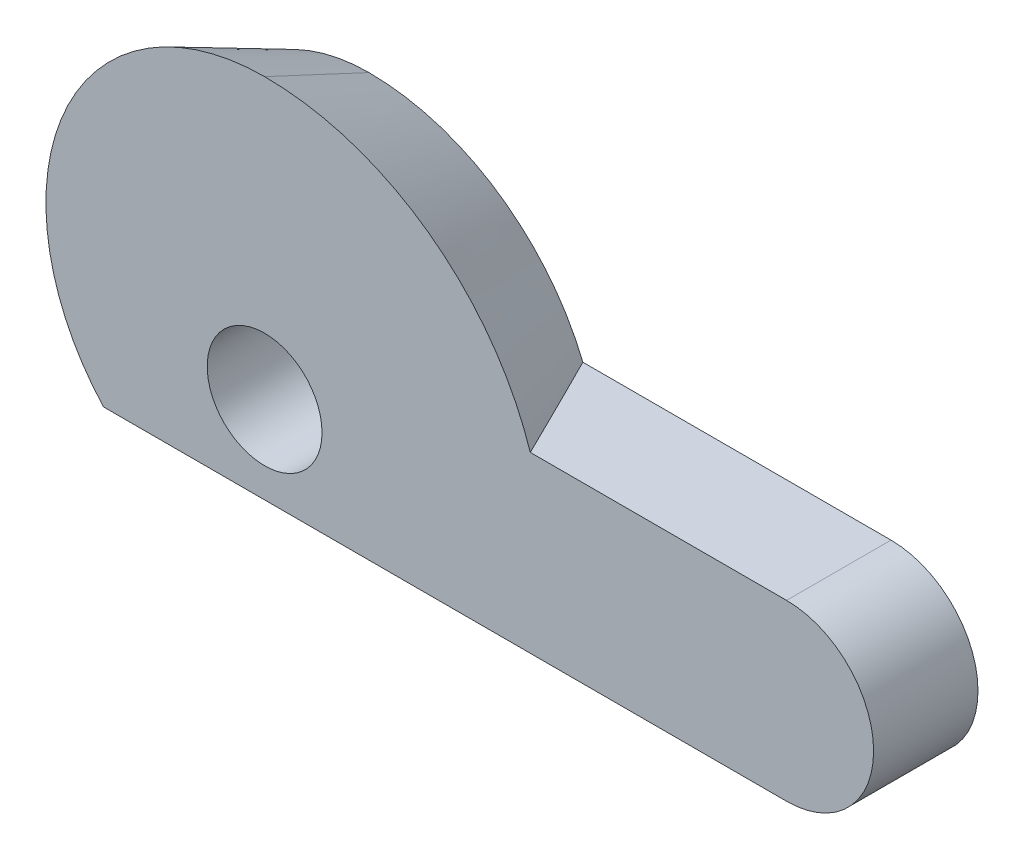
ISO-10303-21;
HEADER;
FILE_DESCRIPTION(('STEP AP214'),'2;1');
FILE_NAME('part.step','',(''),(''),'','','');
FILE_SCHEMA(('AUTOMOTIVE_DESIGN { 1 0 10303 214 1 1 1 1 }'));
ENDSEC;
DATA;
#1=APPLICATION_CONTEXT('core data for automotive mechanical design processes');
#2=APPLICATION_PROTOCOL_DEFINITION('international standard','automotive_design',2000,#1);
#3=PRODUCT_CONTEXT('',#1,'mechanical');
#4=PRODUCT('Part','Part','',(#3));
#5=PRODUCT_RELATED_PRODUCT_CATEGORY('part','',(#4));
#6=PRODUCT_DEFINITION_FORMATION('','',#4);
#7=PRODUCT_DEFINITION_CONTEXT('part definition',#1,'design');
#8=PRODUCT_DEFINITION('design','',#6,#7);
#9=PRODUCT_DEFINITION_SHAPE('','',#8);
#10=(LENGTH_UNIT() NAMED_UNIT(*) SI_UNIT(.MILLI.,.METRE.));
#11=(NAMED_UNIT(*) PLANE_ANGLE_UNIT() SI_UNIT($,.RADIAN.));
#12=(NAMED_UNIT(*) SI_UNIT($,.STERADIAN.) SOLID_ANGLE_UNIT());
#13=UNCERTAINTY_MEASURE_WITH_UNIT(LENGTH_MEASURE(1.E-05),#10,'distance_accuracy_value','');
#14=(GEOMETRIC_REPRESENTATION_CONTEXT(3) GLOBAL_UNCERTAINTY_ASSIGNED_CONTEXT((#13)) GLOBAL_UNIT_ASSIGNED_CONTEXT((#10,
#11,#12)) REPRESENTATION_CONTEXT('',''));
#15=CARTESIAN_POINT('',(0.,0.,0.));
#16=DIRECTION('',(0.,0.,1.));
#17=DIRECTION('',(1.,0.,0.));
#18=AXIS2_PLACEMENT_3D('',#15,#16,#17);
#19=CARTESIAN_POINT('',(15.,0.,3.));
#20=DIRECTION('',(0.,0.,1.));
#21=DIRECTION('',(1.,0.,0.));
#22=AXIS2_PLACEMENT_3D('',#19,#20,#21);
#23=PLANE('',#22);
#24=CARTESIAN_POINT('',(0.,1.75,3.));
#25=DIRECTION('',(0.,0.,1.));
#26=DIRECTION('',(1.,0.,0.));
#27=AXIS2_PLACEMENT_3D('',#24,#25,#26);
#28=CIRCLE('',#27,6.28369234184499);
#29=CARTESIAN_POINT('',(0.,8.03369234184498,3.));
#30=VERTEX_POINT('',#29);
#31=CARTESIAN_POINT('',(-4.62842191756125,-2.5,3.));
#32=VERTEX_POINT('',#31);
#33=EDGE_CURVE('E110',#30,#32,#28,.T.);
#34=ORIENTED_EDGE('',*,*,#33,.T.);
#35=DIRECTION('',(1.,0.,0.));
#36=VECTOR('',#35,1.);
#37=CARTESIAN_POINT('',(15.,-2.5,3.));
#38=LINE('',#37,#36);
#39=CARTESIAN_POINT('',(15.,-2.5,3.));
#40=VERTEX_POINT('',#39);
#41=EDGE_CURVE('E55',#32,#40,#38,.T.);
#42=ORIENTED_EDGE('',*,*,#41,.T.);
#43=CARTESIAN_POINT('',(15.,0.,3.));
#44=DIRECTION('',(0.,0.,1.));
#45=DIRECTION('',(1.,0.,0.));
#46=AXIS2_PLACEMENT_3D('',#43,#44,#45);
#47=CIRCLE('',#46,2.5);
#48=CARTESIAN_POINT('',(15.,2.5,3.));
#49=VERTEX_POINT('',#48);
#50=EDGE_CURVE('E97',#40,#49,#47,.T.);
#51=ORIENTED_EDGE('',*,*,#50,.T.);
#52=DIRECTION('',(-1.,0.,0.));
#53=VECTOR('',#52,1.);
#54=CARTESIAN_POINT('',(15.,2.5,3.));
#55=LINE('',#54,#53);
#56=CARTESIAN_POINT('',(7.63480272459078,2.5,3.));
#57=VERTEX_POINT('',#56);
#58=EDGE_CURVE('E63',#49,#57,#55,.T.);
#59=ORIENTED_EDGE('',*,*,#58,.T.);
#60=CARTESIAN_POINT('',(0.,0.,3.));
#61=DIRECTION('',(0.,0.,1.));
#62=DIRECTION('',(1.,0.,0.));
#63=AXIS2_PLACEMENT_3D('',#60,#61,#62);
#64=CIRCLE('',#63,8.03369234184503);
#65=EDGE_CURVE('E118',#57,#30,#64,.T.);
#66=ORIENTED_EDGE('',*,*,#65,.T.);
#67=EDGE_LOOP('',(#34,#42,#51,#59,#66));
#68=FACE_BOUND('',#67,.T.);
#69=CARTESIAN_POINT('',(0.,0.,3.));
#70=DIRECTION('',(0.,0.,1.));
#71=DIRECTION('',(1.,0.,0.));
#72=AXIS2_PLACEMENT_3D('',#69,#70,#71);
#73=CIRCLE('',#72,1.65);
#74=CARTESIAN_POINT('',(1.65,0.,3.));
#75=VERTEX_POINT('',#74);
#76=EDGE_CURVE('E160',#75,#75,#73,.T.);
#77=ORIENTED_EDGE('',*,*,#76,.F.);
#78=EDGE_LOOP('',(#77));
#79=FACE_BOUND('',#78,.T.);
#80=ADVANCED_FACE('F35',(#68,#79),#23,.T.);
#81=CARTESIAN_POINT('',(15.,0.,0.));
#82=DIRECTION('',(0.,0.,1.));
#83=DIRECTION('',(1.,0.,0.));
#84=AXIS2_PLACEMENT_3D('',#81,#82,#83);
#85=PLANE('',#84);
#86=DIRECTION('',(1.,0.,0.));
#87=VECTOR('',#86,1.);
#88=CARTESIAN_POINT('',(15.,-2.5,0.));
#89=LINE('',#88,#87);
#90=CARTESIAN_POINT('',(-2.40800161388934,-2.5,0.));
#91=VERTEX_POINT('',#90);
#92=CARTESIAN_POINT('',(15.,-2.5,0.));
#93=VERTEX_POINT('',#92);
#94=EDGE_CURVE('E87',#91,#93,#89,.T.);
#95=ORIENTED_EDGE('',*,*,#94,.F.);
#96=CARTESIAN_POINT('',(0.,1.75,0.));
#97=DIRECTION('',(0.,0.,1.));
#98=DIRECTION('',(1.,0.,0.));
#99=AXIS2_PLACEMENT_3D('',#96,#97,#98);
#100=CIRCLE('',#99,4.88476936737997);
#101=CARTESIAN_POINT('',(0.,6.63476936737997,0.));
#102=VERTEX_POINT('',#101);
#103=EDGE_CURVE('E92',#91,#102,#100,.F.);
#104=ORIENTED_EDGE('',*,*,#103,.T.);
#105=CARTESIAN_POINT('',(0.,0.,0.));
#106=DIRECTION('',(0.,0.,1.));
#107=DIRECTION('',(1.,0.,0.));
#108=AXIS2_PLACEMENT_3D('',#105,#106,#107);
#109=CIRCLE('',#108,6.63476936738001);
#110=CARTESIAN_POINT('',(6.14574361312962,2.5,0.));
#111=VERTEX_POINT('',#110);
#112=EDGE_CURVE('E107',#102,#111,#109,.F.);
#113=ORIENTED_EDGE('',*,*,#112,.T.);
#114=DIRECTION('',(-1.,0.,0.));
#115=VECTOR('',#114,1.);
#116=CARTESIAN_POINT('',(15.,2.5,0.));
#117=LINE('',#116,#115);
#118=CARTESIAN_POINT('',(15.,2.5,0.));
#119=VERTEX_POINT('',#118);
#120=EDGE_CURVE('E98',#119,#111,#117,.T.);
#121=ORIENTED_EDGE('',*,*,#120,.F.);
#122=CARTESIAN_POINT('',(15.,0.,0.));
#123=DIRECTION('',(0.,0.,1.));
#124=DIRECTION('',(1.,0.,0.));
#125=AXIS2_PLACEMENT_3D('',#122,#123,#124);
#126=CIRCLE('',#125,2.5);
#127=EDGE_CURVE('E95',#93,#119,#126,.T.);
#128=ORIENTED_EDGE('',*,*,#127,.F.);
#129=EDGE_LOOP('',(#95,#104,#113,#121,#128));
#130=FACE_BOUND('',#129,.T.);
#131=CARTESIAN_POINT('',(0.,0.,0.));
#132=DIRECTION('',(0.,0.,1.));
#133=DIRECTION('',(1.,0.,0.));
#134=AXIS2_PLACEMENT_3D('',#131,#132,#133);
#135=CIRCLE('',#134,1.65);
#136=CARTESIAN_POINT('',(1.65,0.,0.));
#137=VERTEX_POINT('',#136);
#138=EDGE_CURVE('E163',#137,#137,#135,.T.);
#139=ORIENTED_EDGE('',*,*,#138,.T.);
#140=EDGE_LOOP('',(#139));
#141=FACE_BOUND('',#140,.T.);
#142=ADVANCED_FACE('F88',(#130,#141),#85,.F.);
#143=CARTESIAN_POINT('',(15.,0.,3.));
#144=DIRECTION('',(0.,0.,-1.));
#145=DIRECTION('',(-1.,0.,0.));
#146=AXIS2_PLACEMENT_3D('',#143,#144,#145);
#147=CYLINDRICAL_SURFACE('',#146,2.5);
#148=ORIENTED_EDGE('',*,*,#127,.T.);
#149=DIRECTION('',(0.,0.,-1.));
#150=VECTOR('',#149,1.);
#151=CARTESIAN_POINT('',(15.,2.5,3.));
#152=LINE('',#151,#150);
#153=EDGE_CURVE('E108',#49,#119,#152,.T.);
#154=ORIENTED_EDGE('',*,*,#153,.F.);
#155=ORIENTED_EDGE('',*,*,#50,.F.);
#156=DIRECTION('',(0.,0.,-1.));
#157=VECTOR('',#156,1.);
#158=CARTESIAN_POINT('',(15.,-2.5,3.));
#159=LINE('',#158,#157);
#160=EDGE_CURVE('E113',#40,#93,#159,.T.);
#161=ORIENTED_EDGE('',*,*,#160,.T.);
#162=EDGE_LOOP('',(#148,#154,#155,#161));
#163=FACE_BOUND('',#162,.T.);
#164=ADVANCED_FACE('F133',(#163),#147,.T.);
#165=CARTESIAN_POINT('',(15.,2.5,3.));
#166=DIRECTION('',(0.,-1.,0.));
#167=DIRECTION('',(1.,0.,0.));
#168=AXIS2_PLACEMENT_3D('',#165,#166,#167);
#169=PLANE('',#168);
#170=ORIENTED_EDGE('',*,*,#120,.T.);
#171=CARTESIAN_POINT('',(6.14574361312962,2.5,0.));
#172=CARTESIAN_POINT('',(6.27123816993568,2.5,0.249299944932188));
#173=CARTESIAN_POINT('',(6.39630707149005,2.5,0.49881368096005));
#174=CARTESIAN_POINT('',(6.64570803873967,2.5,0.998207205430879));
#175=CARTESIAN_POINT('',(6.77004010915447,2.5,1.24808699151641));
#176=CARTESIAN_POINT('',(7.01808328175662,2.5,1.74815385466408));
#177=CARTESIAN_POINT('',(7.14179438501223,2.5,1.99834093119666));
#178=CARTESIAN_POINT('',(7.38868017891951,2.5,2.49898163920479));
#179=CARTESIAN_POINT('',(7.51185486613386,2.5,2.74943527237565));
#180=CARTESIAN_POINT('',(7.63480272459079,2.5,3.));
#181=B_SPLINE_CURVE_WITH_KNOTS('',3,(#171,#172,#173,#174,#175,#176,#177,#178,#179,#180),
.UNSPECIFIED.,.F.,.F.,(4,2,2,2,4),(0.,0.837312610810785,1.67461985266571,2.51192565358894,
3.34923681202343),.UNSPECIFIED.);
#182=EDGE_CURVE('E49',#111,#57,#181,.T.);
#183=ORIENTED_EDGE('',*,*,#182,.T.);
#184=ORIENTED_EDGE('',*,*,#58,.F.);
#185=ORIENTED_EDGE('',*,*,#153,.T.);
#186=EDGE_LOOP('',(#170,#183,#184,#185));
#187=FACE_BOUND('',#186,.T.);
#188=ADVANCED_FACE('F125',(#187),#169,.F.);
#189=CARTESIAN_POINT('',(15.,-2.5,3.));
#190=DIRECTION('',(0.,1.,0.));
#191=DIRECTION('',(0.,0.,1.));
#192=AXIS2_PLACEMENT_3D('',#189,#190,#191);
#193=PLANE('',#192);
#194=ORIENTED_EDGE('',*,*,#160,.F.);
#195=ORIENTED_EDGE('',*,*,#41,.F.);
#196=CARTESIAN_POINT('',(-7.05000504901995,-2.5,7.17806119933467));
#197=CARTESIAN_POINT('',(-6.93579314198168,-2.5,6.96831607321156));
#198=CARTESIAN_POINT('',(-6.82102302615533,-2.5,6.75887318474393));
#199=CARTESIAN_POINT('',(-6.59016724566101,-2.5,6.34070622949557));
#200=CARTESIAN_POINT('',(-6.47408154384453,-2.5,6.13198218323103));
#201=CARTESIAN_POINT('',(-6.24029663603367,-2.5,5.71519147578387));
#202=CARTESIAN_POINT('',(-6.12259607056551,-2.5,5.50712557630712));
#203=CARTESIAN_POINT('',(-5.88543233404295,-2.5,5.09200239255196));
#204=CARTESIAN_POINT('',(-5.76596917972948,-2.5,4.88494509871872));
#205=CARTESIAN_POINT('',(-5.52258063412192,-2.5,4.46794994862103));
#206=CARTESIAN_POINT('',(-5.398613727738,-2.5,4.25803628851881));
#207=CARTESIAN_POINT('',(-5.14810448406988,-2.5,3.83975209335732));
#208=CARTESIAN_POINT('',(-5.02156217746971,-2.5,3.63138153995336));
#209=CARTESIAN_POINT('',(-4.76540968158676,-2.5,3.21664181289098));
#210=CARTESIAN_POINT('',(-4.63580070147002,-2.5,3.01027189419551));
#211=CARTESIAN_POINT('',(-4.37276294762327,-2.5,2.59998756365815));
#212=CARTESIAN_POINT('',(-4.23933435364602,-2.5,2.3960730369039));
#213=CARTESIAN_POINT('',(-3.96828296273199,-2.5,1.99231649986878));
#214=CARTESIAN_POINT('',(-3.83068085261915,-2.5,1.79246066829881));
#215=CARTESIAN_POINT('',(-3.54938514444876,-2.5,1.39696500811119));
#216=CARTESIAN_POINT('',(-3.40568953648558,-2.5,1.20132660319144));
#217=CARTESIAN_POINT('',(-3.11115104667324,-2.5,0.817011958335836));
#218=CARTESIAN_POINT('',(-2.9603485115205,-2.5,0.628305208852511));
#219=CARTESIAN_POINT('',(-2.72633234530842,-2.5,0.351936272415993));
#220=CARTESIAN_POINT('',(-2.64704646519733,-2.5,0.260951215856611));
#221=CARTESIAN_POINT('',(-2.48539783079971,-2.5,0.0817643955029092));
#222=CARTESIAN_POINT('',(-2.40303538420546,-2.5,-0.00643764500630492));
#223=CARTESIAN_POINT('',(-2.19371510379667,-2.5,-0.221456240041877));
#224=CARTESIAN_POINT('',(-2.06456821959043,-2.5,-0.346165799595977));
#225=CARTESIAN_POINT('',(-1.79568628099834,-2.5,-0.584632777591295));
#226=CARTESIAN_POINT('',(-1.65592624765185,-2.5,-0.698362831651144));
#227=CARTESIAN_POINT('',(-1.43565434264966,-2.5,-0.856462663631282));
#228=CARTESIAN_POINT('',(-1.35986891805872,-2.5,-0.907402906957797));
#229=CARTESIAN_POINT('',(-1.20467778052415,-2.5,-1.00353998881682));
#230=CARTESIAN_POINT('',(-1.12527133807683,-2.5,-1.0487356630191));
#231=CARTESIAN_POINT('',(-0.963036894207919,-2.5,-1.13172599466102));
#232=CARTESIAN_POINT('',(-0.880224083007756,-2.5,-1.1695499375752));
#233=CARTESIAN_POINT('',(-0.711126663513296,-2.5,-1.2362804338859));
#234=CARTESIAN_POINT('',(-0.624845141505748,-2.5,-1.26519472447433));
#235=CARTESIAN_POINT('',(-0.425000818125529,-2.5,-1.31889887327013));
#236=CARTESIAN_POINT('',(-0.310494694978523,-2.5,-1.34033428463522));
#237=CARTESIAN_POINT('',(-0.0795515419635326,-2.5,-1.36301883945269));
#238=CARTESIAN_POINT('',(0.036883499926279,-2.5,-1.36428761132961));
#239=CARTESIAN_POINT('',(0.26800834448745,-2.5,-1.34652420976068));
#240=CARTESIAN_POINT('',(0.382699886523279,-2.5,-1.32751382832712));
#241=CARTESIAN_POINT('',(0.607623878105413,-2.5,-1.27171979126082));
#242=CARTESIAN_POINT('',(0.717852915458901,-2.5,-1.23492280349383));
#243=CARTESIAN_POINT('',(0.910837469563712,-2.5,-1.1560592885019));
#244=CARTESIAN_POINT('',(0.994665991609906,-2.5,-1.11653357466894));
#245=CARTESIAN_POINT('',(1.15854516691152,-2.5,-1.03023442106815));
#246=CARTESIAN_POINT('',(1.23859318638501,-2.5,-0.983456022944898));
#247=CARTESIAN_POINT('',(1.39582961541855,-2.5,-0.883663496184199));
#248=CARTESIAN_POINT('',(1.47297975675522,-2.5,-0.830589726490606));
#249=CARTESIAN_POINT('',(1.62382626983449,-2.5,-0.719847947204714));
#250=CARTESIAN_POINT('',(1.69752413822607,-2.5,-0.662181958287974));
#251=CARTESIAN_POINT('',(1.89609464670314,-2.5,-0.498504601101564));
#252=CARTESIAN_POINT('',(2.01783983684209,-2.5,-0.388705691249882));
#253=CARTESIAN_POINT('',(2.25392097910188,-2.5,-0.16135644047851));
#254=CARTESIAN_POINT('',(2.36825047293411,-2.5,-0.0437995182070258));
#255=CARTESIAN_POINT('',(2.59137863554609,-2.5,0.197336320755371));
#256=CARTESIAN_POINT('',(2.70015200321929,-2.5,0.32093849866002));
#257=CARTESIAN_POINT('',(2.91283031295252,-2.5,0.572268146050757));
#258=CARTESIAN_POINT('',(3.01673447611763,-2.5,0.699996270054576));
#259=CARTESIAN_POINT('',(3.21287440004009,-2.5,0.948843492885501));
#260=CARTESIAN_POINT('',(3.30539951621654,-2.5,1.06973561122296));
#261=CARTESIAN_POINT('',(3.48759650172471,-2.5,1.31366614251518));
#262=CARTESIAN_POINT('',(3.57726805742447,-2.5,1.43670478910756));
#263=CARTESIAN_POINT('',(3.75328363591241,-2.5,1.68323925826029));
#264=CARTESIAN_POINT('',(3.83965231142838,-2.5,1.80671753462223));
#265=CARTESIAN_POINT('',(4.01032045009918,-2.5,2.05504879486988));
#266=CARTESIAN_POINT('',(4.09462045946492,-2.5,2.17990140298556));
#267=CARTESIAN_POINT('',(4.17806119933472,-2.5,2.30531695784081));
#268=B_SPLINE_CURVE_WITH_KNOTS('',3,(#196,#197,#198,#199,#200,#201,#202,#203,#204,#205,#206,
#207,#208,#209,#210,#211,#212,#213,#214,#215,#216,#217,#218,#219,#220,#221,#222,#223,#224,#225,
#226,#227,#228,#229,#230,#231,#232,#233,#234,#235,#236,#237,#238,#239,#240,#241,#242,#243,#244,
#245,#246,#247,#248,#249,#250,#251,#252,#253,#254,#255,#256,#257,#258,#259,#260,#261,#262,#263,
#264,#265,#266,#267),.UNSPECIFIED.,.F.,.F.,(4,2,2,2,2,2,2,2,2,2,2,2,2,2,2,2,2,2,2,2,2,2,2,2,2,2,
2,2,2,2,2,2,2,2,2,4),(0.,0.716476386438855,1.43297305485751,2.15011525871413,2.86725065558745,
3.59859295559326,4.32992654727912,5.06097643295444,5.79199197146359,6.51983889450939,
7.24792779010281,7.97229007354674,8.33428354664485,8.6962409126288,9.23442155411509,
9.77391063951049,10.0476566576124,10.3214580713795,10.5941485390541,10.8666015290548,
11.2144348797438,11.5619296594372,11.9090513964722,12.2564337266103,12.5340788106321,
12.8119145527857,13.0926318174946,13.3732262359197,13.8645189240311,14.3562338853321,
14.8500182052452,15.3438812448665,15.8005403619115,16.2572494977555,16.7092875836803,
17.1612050003877),.UNSPECIFIED.);
#269=EDGE_CURVE('E11',#32,#91,#268,.T.);
#270=ORIENTED_EDGE('',*,*,#269,.T.);
#271=ORIENTED_EDGE('',*,*,#94,.T.);
#272=EDGE_LOOP('',(#194,#195,#270,#271));
#273=FACE_BOUND('',#272,.T.);
#274=ADVANCED_FACE('F100',(#273),#193,.F.);
#275=CARTESIAN_POINT('',(0.,0.,3.));
#276=DIRECTION('',(0.,0.,-1.));
#277=DIRECTION('',(-1.,0.,0.));
#278=AXIS2_PLACEMENT_3D('',#275,#276,#277);
#279=CYLINDRICAL_SURFACE('',#278,1.65);
#280=ORIENTED_EDGE('',*,*,#76,.T.);
#281=EDGE_LOOP('',(#280));
#282=FACE_BOUND('',#281,.T.);
#283=ORIENTED_EDGE('',*,*,#138,.F.);
#284=EDGE_LOOP('',(#283));
#285=FACE_BOUND('',#284,.T.);
#286=ADVANCED_FACE('F148',(#282,#285),#279,.F.);
#287=CARTESIAN_POINT('',(0.,1.75,4.00000000000001));
#288=DIRECTION('',(0.,0.,1.));
#289=DIRECTION('',(1.,0.,0.));
#290=AXIS2_PLACEMENT_3D('',#287,#288,#289);
#291=CONICAL_SURFACE('',#290,6.75,0.436332312998589);
#292=ORIENTED_EDGE('',*,*,#269,.F.);
#293=ORIENTED_EDGE('',*,*,#33,.F.);
#294=DIRECTION('',(0.,0.422618261740706,0.906307787036647));
#295=VECTOR('',#294,1.);
#296=CARTESIAN_POINT('',(0.,6.63476936737997,0.));
#297=LINE('',#296,#295);
#298=EDGE_CURVE('E106',#102,#30,#297,.T.);
#299=ORIENTED_EDGE('',*,*,#298,.F.);
#300=ORIENTED_EDGE('',*,*,#103,.F.);
#301=EDGE_LOOP('',(#292,#293,#299,#300));
#302=FACE_BOUND('',#301,.T.);
#303=ADVANCED_FACE('F37',(#302),#291,.T.);
#304=CARTESIAN_POINT('',(0.,0.,4.00000000000001));
#305=DIRECTION('',(0.,0.,1.));
#306=DIRECTION('',(1.,0.,0.));
#307=AXIS2_PLACEMENT_3D('',#304,#305,#306);
#308=CONICAL_SURFACE('',#307,8.50000000000004,0.436332312998589);
#309=ORIENTED_EDGE('',*,*,#182,.F.);
#310=ORIENTED_EDGE('',*,*,#112,.F.);
#311=ORIENTED_EDGE('',*,*,#298,.T.);
#312=ORIENTED_EDGE('',*,*,#65,.F.);
#313=EDGE_LOOP('',(#309,#310,#311,#312));
#314=FACE_BOUND('',#313,.T.);
#315=ADVANCED_FACE('F129',(#314),#308,.T.);
#316=CLOSED_SHELL('',(#80,#142,#164,#188,#274,#286,#303,#315));
#317=MANIFOLD_SOLID_BREP('B2',#316);
#318=ADVANCED_BREP_SHAPE_REPRESENTATION('',(#18,#317),#14);
#319=SHAPE_DEFINITION_REPRESENTATION(#9,#318);
ENDSEC;
END-ISO-10303-21;
